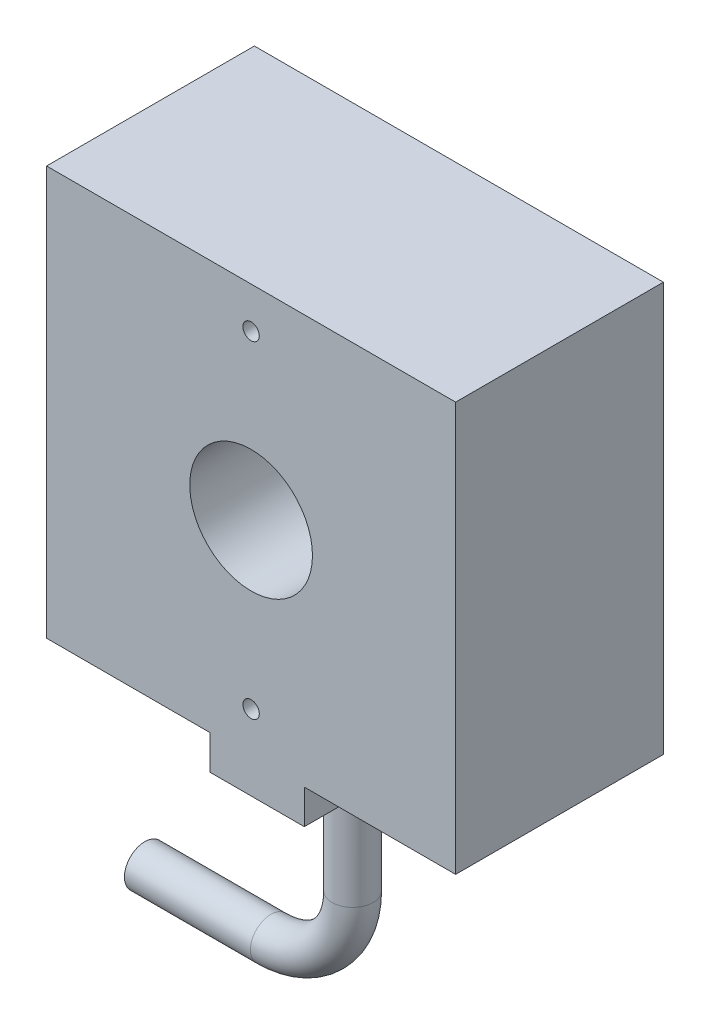
ISO-10303-21;
HEADER;
FILE_DESCRIPTION(('STEP AP214'),'2;1');
FILE_NAME('part.step','',(''),(''),'','','');
FILE_SCHEMA(('AUTOMOTIVE_DESIGN { 1 0 10303 214 1 1 1 1 }'));
ENDSEC;
DATA;
#1=APPLICATION_CONTEXT('core data for automotive mechanical design processes');
#2=APPLICATION_PROTOCOL_DEFINITION('international standard','automotive_design',2000,#1);
#3=PRODUCT_CONTEXT('',#1,'mechanical');
#4=PRODUCT('Part','Part','',(#3));
#5=PRODUCT_RELATED_PRODUCT_CATEGORY('part','',(#4));
#6=PRODUCT_DEFINITION_FORMATION('','',#4);
#7=PRODUCT_DEFINITION_CONTEXT('part definition',#1,'design');
#8=PRODUCT_DEFINITION('design','',#6,#7);
#9=PRODUCT_DEFINITION_SHAPE('','',#8);
#10=(LENGTH_UNIT() NAMED_UNIT(*) SI_UNIT(.MILLI.,.METRE.));
#11=(NAMED_UNIT(*) PLANE_ANGLE_UNIT() SI_UNIT($,.RADIAN.));
#12=(NAMED_UNIT(*) SI_UNIT($,.STERADIAN.) SOLID_ANGLE_UNIT());
#13=UNCERTAINTY_MEASURE_WITH_UNIT(LENGTH_MEASURE(1.E-05),#10,'distance_accuracy_value','');
#14=(GEOMETRIC_REPRESENTATION_CONTEXT(3) GLOBAL_UNCERTAINTY_ASSIGNED_CONTEXT((#13)) GLOBAL_UNIT_ASSIGNED_CONTEXT((#10,
#11,#12)) REPRESENTATION_CONTEXT('',''));
#15=CARTESIAN_POINT('',(0.,0.,0.));
#16=DIRECTION('',(0.,0.,1.));
#17=DIRECTION('',(1.,0.,0.));
#18=AXIS2_PLACEMENT_3D('',#15,#16,#17);
#19=CARTESIAN_POINT('',(0.,0.,25.4));
#20=DIRECTION('',(0.,1.,0.));
#21=DIRECTION('',(0.,0.,1.));
#22=AXIS2_PLACEMENT_3D('',#19,#20,#21);
#23=PLANE('',#22);
#24=DIRECTION('',(0.,0.,1.));
#25=VECTOR('',#24,1.);
#26=CARTESIAN_POINT('',(31.5062580287799,0.,-12.2486169609837));
#27=LINE('',#26,#25);
#28=CARTESIAN_POINT('',(31.5062580287799,0.,0.));
#29=VERTEX_POINT('',#28);
#30=CARTESIAN_POINT('',(31.5062580287799,0.,25.4));
#31=VERTEX_POINT('',#30);
#32=EDGE_CURVE('E128',#29,#31,#27,.T.);
#33=ORIENTED_EDGE('',*,*,#32,.F.);
#34=DIRECTION('',(1.,0.,0.));
#35=VECTOR('',#34,1.);
#36=CARTESIAN_POINT('',(0.,0.,0.));
#37=LINE('',#36,#35);
#38=CARTESIAN_POINT('',(50.,0.,0.));
#39=VERTEX_POINT('',#38);
#40=EDGE_CURVE('E124',#29,#39,#37,.T.);
#41=ORIENTED_EDGE('',*,*,#40,.T.);
#42=DIRECTION('',(0.,0.,-1.));
#43=VECTOR('',#42,1.);
#44=CARTESIAN_POINT('',(50.,0.,25.4));
#45=LINE('',#44,#43);
#46=CARTESIAN_POINT('',(50.,0.,25.4));
#47=VERTEX_POINT('',#46);
#48=EDGE_CURVE('E214',#47,#39,#45,.T.);
#49=ORIENTED_EDGE('',*,*,#48,.F.);
#50=DIRECTION('',(1.,0.,0.));
#51=VECTOR('',#50,1.);
#52=CARTESIAN_POINT('',(0.,0.,25.4));
#53=LINE('',#52,#51);
#54=EDGE_CURVE('E189',#31,#47,#53,.T.);
#55=ORIENTED_EDGE('',*,*,#54,.F.);
#56=EDGE_LOOP('',(#33,#41,#49,#55));
#57=FACE_BOUND('',#56,.T.);
#58=ADVANCED_FACE('F39',(#57),#23,.F.);
#59=CARTESIAN_POINT('',(0.,0.,25.4));
#60=DIRECTION('',(1.,0.,0.));
#61=DIRECTION('',(0.,0.,-1.));
#62=AXIS2_PLACEMENT_3D('',#59,#60,#61);
#63=PLANE('',#62);
#64=DIRECTION('',(0.,-1.,0.));
#65=VECTOR('',#64,1.);
#66=CARTESIAN_POINT('',(0.,0.,0.));
#67=LINE('',#66,#65);
#68=CARTESIAN_POINT('',(0.,50.,0.));
#69=VERTEX_POINT('',#68);
#70=CARTESIAN_POINT('',(0.,0.,0.));
#71=VERTEX_POINT('',#70);
#72=EDGE_CURVE('E182',#69,#71,#67,.T.);
#73=ORIENTED_EDGE('',*,*,#72,.T.);
#74=DIRECTION('',(0.,0.,-1.));
#75=VECTOR('',#74,1.);
#76=CARTESIAN_POINT('',(0.,0.,25.4));
#77=LINE('',#76,#75);
#78=CARTESIAN_POINT('',(0.,0.,25.4));
#79=VERTEX_POINT('',#78);
#80=EDGE_CURVE('E43',#79,#71,#77,.T.);
#81=ORIENTED_EDGE('',*,*,#80,.F.);
#82=DIRECTION('',(0.,-1.,0.));
#83=VECTOR('',#82,1.);
#84=CARTESIAN_POINT('',(0.,0.,25.4));
#85=LINE('',#84,#83);
#86=CARTESIAN_POINT('',(0.,50.,25.4));
#87=VERTEX_POINT('',#86);
#88=EDGE_CURVE('E186',#87,#79,#85,.T.);
#89=ORIENTED_EDGE('',*,*,#88,.F.);
#90=DIRECTION('',(0.,0.,-1.));
#91=VECTOR('',#90,1.);
#92=CARTESIAN_POINT('',(0.,50.,25.4));
#93=LINE('',#92,#91);
#94=EDGE_CURVE('E197',#87,#69,#93,.T.);
#95=ORIENTED_EDGE('',*,*,#94,.T.);
#96=EDGE_LOOP('',(#73,#81,#89,#95));
#97=FACE_BOUND('',#96,.T.);
#98=ADVANCED_FACE('F41',(#97),#63,.F.);
#99=CARTESIAN_POINT('',(19.9993223415163,0.,0.));
#100=VERTEX_POINT('',#99);
#101=EDGE_CURVE('E201',#71,#100,#37,.T.);
#102=ORIENTED_EDGE('',*,*,#101,.T.);
#103=DIRECTION('',(0.,0.,1.));
#104=VECTOR('',#103,1.);
#105=CARTESIAN_POINT('',(19.9993223415163,0.,-12.2486169609837));
#106=LINE('',#105,#104);
#107=CARTESIAN_POINT('',(19.9993223415163,0.,25.4));
#108=VERTEX_POINT('',#107);
#109=EDGE_CURVE('E153',#100,#108,#106,.T.);
#110=ORIENTED_EDGE('',*,*,#109,.T.);
#111=EDGE_CURVE('E93',#79,#108,#53,.T.);
#112=ORIENTED_EDGE('',*,*,#111,.F.);
#113=ORIENTED_EDGE('',*,*,#80,.T.);
#114=EDGE_LOOP('',(#102,#110,#112,#113));
#115=FACE_BOUND('',#114,.T.);
#116=ADVANCED_FACE('F222',(#115),#23,.F.);
#117=CARTESIAN_POINT('',(50.,0.,25.4));
#118=DIRECTION('',(-1.,0.,0.));
#119=DIRECTION('',(0.,0.,1.));
#120=AXIS2_PLACEMENT_3D('',#117,#118,#119);
#121=PLANE('',#120);
#122=DIRECTION('',(0.,1.,0.));
#123=VECTOR('',#122,1.);
#124=CARTESIAN_POINT('',(50.,0.,0.));
#125=LINE('',#124,#123);
#126=CARTESIAN_POINT('',(50.,50.,0.));
#127=VERTEX_POINT('',#126);
#128=EDGE_CURVE('E205',#39,#127,#125,.T.);
#129=ORIENTED_EDGE('',*,*,#128,.T.);
#130=DIRECTION('',(0.,0.,-1.));
#131=VECTOR('',#130,1.);
#132=CARTESIAN_POINT('',(50.,50.,25.4));
#133=LINE('',#132,#131);
#134=CARTESIAN_POINT('',(50.,50.,25.4));
#135=VERTEX_POINT('',#134);
#136=EDGE_CURVE('E212',#135,#127,#133,.T.);
#137=ORIENTED_EDGE('',*,*,#136,.F.);
#138=DIRECTION('',(0.,1.,0.));
#139=VECTOR('',#138,1.);
#140=CARTESIAN_POINT('',(50.,0.,25.4));
#141=LINE('',#140,#139);
#142=EDGE_CURVE('E192',#47,#135,#141,.T.);
#143=ORIENTED_EDGE('',*,*,#142,.F.);
#144=ORIENTED_EDGE('',*,*,#48,.T.);
#145=EDGE_LOOP('',(#129,#137,#143,#144));
#146=FACE_BOUND('',#145,.T.);
#147=ADVANCED_FACE('F273',(#146),#121,.F.);
#148=CARTESIAN_POINT('',(0.,50.,25.4));
#149=DIRECTION('',(0.,-1.,0.));
#150=DIRECTION('',(0.,0.,-1.));
#151=AXIS2_PLACEMENT_3D('',#148,#149,#150);
#152=PLANE('',#151);
#153=DIRECTION('',(-1.,0.,0.));
#154=VECTOR('',#153,1.);
#155=CARTESIAN_POINT('',(0.,50.,0.));
#156=LINE('',#155,#154);
#157=EDGE_CURVE('E86',#127,#69,#156,.T.);
#158=ORIENTED_EDGE('',*,*,#157,.T.);
#159=ORIENTED_EDGE('',*,*,#94,.F.);
#160=DIRECTION('',(-1.,0.,0.));
#161=VECTOR('',#160,1.);
#162=CARTESIAN_POINT('',(0.,50.,25.4));
#163=LINE('',#162,#161);
#164=EDGE_CURVE('E65',#135,#87,#163,.T.);
#165=ORIENTED_EDGE('',*,*,#164,.F.);
#166=ORIENTED_EDGE('',*,*,#136,.T.);
#167=EDGE_LOOP('',(#158,#159,#165,#166));
#168=FACE_BOUND('',#167,.T.);
#169=ADVANCED_FACE('F277',(#168),#152,.F.);
#170=CARTESIAN_POINT('',(0.,0.,25.4));
#171=DIRECTION('',(0.,0.,-1.));
#172=DIRECTION('',(-1.,0.,0.));
#173=AXIS2_PLACEMENT_3D('',#170,#171,#172);
#174=PLANE('',#173);
#175=CARTESIAN_POINT('',(25.,5.,25.4));
#176=DIRECTION('',(0.,0.,1.));
#177=DIRECTION('',(1.,0.,0.));
#178=AXIS2_PLACEMENT_3D('',#175,#176,#177);
#179=CIRCLE('',#178,1.);
#180=CARTESIAN_POINT('',(26.,5.,25.4));
#181=VERTEX_POINT('',#180);
#182=EDGE_CURVE('E161',#181,#181,#179,.T.);
#183=ORIENTED_EDGE('',*,*,#182,.F.);
#184=EDGE_LOOP('',(#183));
#185=FACE_BOUND('',#184,.T.);
#186=CARTESIAN_POINT('',(25.,45.,25.4));
#187=DIRECTION('',(0.,0.,1.));
#188=DIRECTION('',(1.,0.,0.));
#189=AXIS2_PLACEMENT_3D('',#186,#187,#188);
#190=CIRCLE('',#189,1.);
#191=CARTESIAN_POINT('',(26.,45.,25.4));
#192=VERTEX_POINT('',#191);
#193=EDGE_CURVE('E167',#192,#192,#190,.T.);
#194=ORIENTED_EDGE('',*,*,#193,.F.);
#195=EDGE_LOOP('',(#194));
#196=FACE_BOUND('',#195,.T.);
#197=CARTESIAN_POINT('',(25.,25.,25.4));
#198=DIRECTION('',(0.,0.,1.));
#199=DIRECTION('',(1.,0.,0.));
#200=AXIS2_PLACEMENT_3D('',#197,#198,#199);
#201=CIRCLE('',#200,7.5);
#202=CARTESIAN_POINT('',(32.5,25.,25.4));
#203=VERTEX_POINT('',#202);
#204=EDGE_CURVE('E166',#203,#203,#201,.T.);
#205=ORIENTED_EDGE('',*,*,#204,.F.);
#206=EDGE_LOOP('',(#205));
#207=FACE_BOUND('',#206,.T.);
#208=ORIENTED_EDGE('',*,*,#88,.T.);
#209=ORIENTED_EDGE('',*,*,#111,.T.);
#210=DIRECTION('',(0.,-1.,0.));
#211=VECTOR('',#210,1.);
#212=CARTESIAN_POINT('',(19.9993223415163,0.,25.4));
#213=LINE('',#212,#211);
#214=CARTESIAN_POINT('',(19.9993223415163,-4.19750503824342,25.4));
#215=VERTEX_POINT('',#214);
#216=EDGE_CURVE('E56',#108,#215,#213,.T.);
#217=ORIENTED_EDGE('',*,*,#216,.T.);
#218=DIRECTION('',(1.,0.,0.));
#219=VECTOR('',#218,1.);
#220=CARTESIAN_POINT('',(19.9993223415163,-4.19750503824342,25.4));
#221=LINE('',#220,#219);
#222=CARTESIAN_POINT('',(31.5062580287799,-4.19750503824342,25.4));
#223=VERTEX_POINT('',#222);
#224=EDGE_CURVE('E146',#215,#223,#221,.T.);
#225=ORIENTED_EDGE('',*,*,#224,.T.);
#226=DIRECTION('',(0.,1.,0.));
#227=VECTOR('',#226,1.);
#228=CARTESIAN_POINT('',(31.5062580287799,0.,25.4));
#229=LINE('',#228,#227);
#230=EDGE_CURVE('E134',#223,#31,#229,.T.);
#231=ORIENTED_EDGE('',*,*,#230,.T.);
#232=ORIENTED_EDGE('',*,*,#54,.T.);
#233=ORIENTED_EDGE('',*,*,#142,.T.);
#234=ORIENTED_EDGE('',*,*,#164,.T.);
#235=EDGE_LOOP('',(#208,#209,#217,#225,#231,#232,#233,#234));
#236=FACE_BOUND('',#235,.T.);
#237=ADVANCED_FACE('F226',(#185,#196,#207,#236),#174,.F.);
#238=CARTESIAN_POINT('',(0.,0.,0.));
#239=DIRECTION('',(0.,0.,-1.));
#240=DIRECTION('',(-1.,0.,0.));
#241=AXIS2_PLACEMENT_3D('',#238,#239,#240);
#242=PLANE('',#241);
#243=CARTESIAN_POINT('',(25.,5.,0.));
#244=DIRECTION('',(0.,0.,1.));
#245=DIRECTION('',(1.,0.,0.));
#246=AXIS2_PLACEMENT_3D('',#243,#244,#245);
#247=CIRCLE('',#246,1.);
#248=CARTESIAN_POINT('',(26.,5.,0.));
#249=VERTEX_POINT('',#248);
#250=EDGE_CURVE('E171',#249,#249,#247,.T.);
#251=ORIENTED_EDGE('',*,*,#250,.T.);
#252=EDGE_LOOP('',(#251));
#253=FACE_BOUND('',#252,.T.);
#254=CARTESIAN_POINT('',(25.,45.,0.));
#255=DIRECTION('',(0.,0.,1.));
#256=DIRECTION('',(1.,0.,0.));
#257=AXIS2_PLACEMENT_3D('',#254,#255,#256);
#258=CIRCLE('',#257,1.);
#259=CARTESIAN_POINT('',(26.,45.,0.));
#260=VERTEX_POINT('',#259);
#261=EDGE_CURVE('E162',#260,#260,#258,.T.);
#262=ORIENTED_EDGE('',*,*,#261,.T.);
#263=EDGE_LOOP('',(#262));
#264=FACE_BOUND('',#263,.T.);
#265=CARTESIAN_POINT('',(25.,25.,0.));
#266=DIRECTION('',(0.,0.,1.));
#267=DIRECTION('',(1.,0.,0.));
#268=AXIS2_PLACEMENT_3D('',#265,#266,#267);
#269=CIRCLE('',#268,7.5);
#270=CARTESIAN_POINT('',(32.5,25.,0.));
#271=VERTEX_POINT('',#270);
#272=EDGE_CURVE('E178',#271,#271,#269,.T.);
#273=ORIENTED_EDGE('',*,*,#272,.T.);
#274=EDGE_LOOP('',(#273));
#275=FACE_BOUND('',#274,.T.);
#276=ORIENTED_EDGE('',*,*,#72,.F.);
#277=ORIENTED_EDGE('',*,*,#157,.F.);
#278=ORIENTED_EDGE('',*,*,#128,.F.);
#279=ORIENTED_EDGE('',*,*,#40,.F.);
#280=DIRECTION('',(0.,1.,0.));
#281=VECTOR('',#280,1.);
#282=CARTESIAN_POINT('',(31.5062580287799,0.,0.));
#283=LINE('',#282,#281);
#284=CARTESIAN_POINT('',(31.5062580287799,-4.19750503824342,0.));
#285=VERTEX_POINT('',#284);
#286=EDGE_CURVE('E116',#285,#29,#283,.T.);
#287=ORIENTED_EDGE('',*,*,#286,.F.);
#288=DIRECTION('',(1.,0.,0.));
#289=VECTOR('',#288,1.);
#290=CARTESIAN_POINT('',(19.9993223415163,-4.19750503824342,0.));
#291=LINE('',#290,#289);
#292=CARTESIAN_POINT('',(19.9993223415163,-4.19750503824342,0.));
#293=VERTEX_POINT('',#292);
#294=EDGE_CURVE('E121',#293,#285,#291,.T.);
#295=ORIENTED_EDGE('',*,*,#294,.F.);
#296=DIRECTION('',(0.,-1.,0.));
#297=VECTOR('',#296,1.);
#298=CARTESIAN_POINT('',(19.9993223415163,0.,0.));
#299=LINE('',#298,#297);
#300=EDGE_CURVE('E151',#100,#293,#299,.T.);
#301=ORIENTED_EDGE('',*,*,#300,.F.);
#302=ORIENTED_EDGE('',*,*,#101,.F.);
#303=EDGE_LOOP('',(#276,#277,#278,#279,#287,#295,#301,#302));
#304=FACE_BOUND('',#303,.T.);
#305=ADVANCED_FACE('F119',(#253,#264,#275,#304),#242,.T.);
#306=CARTESIAN_POINT('',(25.,25.,0.));
#307=DIRECTION('',(0.,0.,1.));
#308=DIRECTION('',(1.,0.,0.));
#309=AXIS2_PLACEMENT_3D('',#306,#307,#308);
#310=CYLINDRICAL_SURFACE('',#309,7.5);
#311=ORIENTED_EDGE('',*,*,#272,.F.);
#312=EDGE_LOOP('',(#311));
#313=FACE_BOUND('',#312,.T.);
#314=ORIENTED_EDGE('',*,*,#204,.T.);
#315=EDGE_LOOP('',(#314));
#316=FACE_BOUND('',#315,.T.);
#317=ADVANCED_FACE('F285',(#313,#316),#310,.F.);
#318=CARTESIAN_POINT('',(25.,45.,0.));
#319=DIRECTION('',(0.,0.,1.));
#320=DIRECTION('',(1.,0.,0.));
#321=AXIS2_PLACEMENT_3D('',#318,#319,#320);
#322=CYLINDRICAL_SURFACE('',#321,1.);
#323=ORIENTED_EDGE('',*,*,#261,.F.);
#324=EDGE_LOOP('',(#323));
#325=FACE_BOUND('',#324,.T.);
#326=ORIENTED_EDGE('',*,*,#193,.T.);
#327=EDGE_LOOP('',(#326));
#328=FACE_BOUND('',#327,.T.);
#329=ADVANCED_FACE('F262',(#325,#328),#322,.F.);
#330=CARTESIAN_POINT('',(25.,5.,0.));
#331=DIRECTION('',(0.,0.,1.));
#332=DIRECTION('',(1.,0.,0.));
#333=AXIS2_PLACEMENT_3D('',#330,#331,#332);
#334=CYLINDRICAL_SURFACE('',#333,1.);
#335=ORIENTED_EDGE('',*,*,#250,.F.);
#336=EDGE_LOOP('',(#335));
#337=FACE_BOUND('',#336,.T.);
#338=ORIENTED_EDGE('',*,*,#182,.T.);
#339=EDGE_LOOP('',(#338));
#340=FACE_BOUND('',#339,.T.);
#341=ADVANCED_FACE('F255',(#337,#340),#334,.F.);
#342=CARTESIAN_POINT('',(19.9993223415163,-4.19750503824342,-12.2486169609837));
#343=DIRECTION('',(0.,-1.,0.));
#344=DIRECTION('',(0.,0.,-1.));
#345=AXIS2_PLACEMENT_3D('',#342,#343,#344);
#346=PLANE('',#345);
#347=CARTESIAN_POINT('',(25.836773000717,-4.19750503824342,13.8253154147573));
#348=DIRECTION('',(0.,-1.,0.));
#349=DIRECTION('',(0.,0.,-1.));
#350=AXIS2_PLACEMENT_3D('',#347,#348,#349);
#351=CIRCLE('',#350,2.5);
#352=CARTESIAN_POINT('',(25.836773000717,-4.19750503824342,11.3253154147573));
#353=VERTEX_POINT('',#352);
#354=EDGE_CURVE('E11',#353,#353,#351,.T.);
#355=ORIENTED_EDGE('',*,*,#354,.F.);
#356=EDGE_LOOP('',(#355));
#357=FACE_BOUND('',#356,.T.);
#358=DIRECTION('',(0.,0.,1.));
#359=VECTOR('',#358,1.);
#360=CARTESIAN_POINT('',(19.9993223415163,-4.19750503824342,-12.2486169609837));
#361=LINE('',#360,#359);
#362=EDGE_CURVE('E142',#293,#215,#361,.T.);
#363=ORIENTED_EDGE('',*,*,#362,.F.);
#364=ORIENTED_EDGE('',*,*,#294,.T.);
#365=DIRECTION('',(0.,0.,1.));
#366=VECTOR('',#365,1.);
#367=CARTESIAN_POINT('',(31.5062580287799,-4.19750503824342,-12.2486169609837));
#368=LINE('',#367,#366);
#369=EDGE_CURVE('E129',#285,#223,#368,.T.);
#370=ORIENTED_EDGE('',*,*,#369,.T.);
#371=ORIENTED_EDGE('',*,*,#224,.F.);
#372=EDGE_LOOP('',(#363,#364,#370,#371));
#373=FACE_BOUND('',#372,.T.);
#374=ADVANCED_FACE('F141',(#357,#373),#346,.T.);
#375=CARTESIAN_POINT('',(31.5062580287799,0.,-12.2486169609837));
#376=DIRECTION('',(1.,0.,0.));
#377=DIRECTION('',(0.,0.,-1.));
#378=AXIS2_PLACEMENT_3D('',#375,#376,#377);
#379=PLANE('',#378);
#380=ORIENTED_EDGE('',*,*,#369,.F.);
#381=ORIENTED_EDGE('',*,*,#286,.T.);
#382=ORIENTED_EDGE('',*,*,#32,.T.);
#383=ORIENTED_EDGE('',*,*,#230,.F.);
#384=EDGE_LOOP('',(#380,#381,#382,#383));
#385=FACE_BOUND('',#384,.T.);
#386=ADVANCED_FACE('F132',(#385),#379,.T.);
#387=CARTESIAN_POINT('',(19.9993223415163,0.,-12.2486169609837));
#388=DIRECTION('',(-1.,0.,0.));
#389=DIRECTION('',(0.,0.,1.));
#390=AXIS2_PLACEMENT_3D('',#387,#388,#389);
#391=PLANE('',#390);
#392=ORIENTED_EDGE('',*,*,#109,.F.);
#393=ORIENTED_EDGE('',*,*,#300,.T.);
#394=ORIENTED_EDGE('',*,*,#362,.T.);
#395=ORIENTED_EDGE('',*,*,#216,.F.);
#396=EDGE_LOOP('',(#392,#393,#394,#395));
#397=FACE_BOUND('',#396,.T.);
#398=ADVANCED_FACE('F225',(#397),#391,.T.);
#399=CARTESIAN_POINT('',(0.436773000717001,-29.5975050382434,13.8253154147573));
#400=DIRECTION('',(-1.,0.,0.));
#401=DIRECTION('',(0.,0.,-1.));
#402=AXIS2_PLACEMENT_3D('',#399,#400,#401);
#403=PLANE('',#402);
#404=CARTESIAN_POINT('',(0.436773000717001,-29.5975050382434,13.8253154147573));
#405=DIRECTION('',(-1.,0.,0.));
#406=DIRECTION('',(0.,0.,-1.));
#407=AXIS2_PLACEMENT_3D('',#404,#405,#406);
#408=CIRCLE('',#407,2.5);
#409=CARTESIAN_POINT('',(0.436773000717001,-29.5975050382434,11.3253154147573));
#410=VERTEX_POINT('',#409);
#411=EDGE_CURVE('E228',#410,#410,#408,.T.);
#412=ORIENTED_EDGE('',*,*,#411,.T.);
#413=EDGE_LOOP('',(#412));
#414=FACE_BOUND('',#413,.T.);
#415=ADVANCED_FACE('F250',(#414),#403,.T.);
#416=CARTESIAN_POINT('',(25.836773000717,-4.19750503824342,13.8253154147573));
#417=DIRECTION('',(0.,-1.,0.));
#418=DIRECTION('',(0.,0.,-1.));
#419=AXIS2_PLACEMENT_3D('',#416,#417,#418);
#420=CYLINDRICAL_SURFACE('',#419,2.5);
#421=CARTESIAN_POINT('',(25.836773000717,-19.5975050382433,13.8253154147573));
#422=DIRECTION('',(0.,-1.,0.));
#423=DIRECTION('',(0.,0.,-1.));
#424=AXIS2_PLACEMENT_3D('',#421,#422,#423);
#425=CIRCLE('',#424,2.5);
#426=CARTESIAN_POINT('',(28.336773000717,-19.5975050382433,13.8253154147573));
#427=VERTEX_POINT('',#426);
#428=EDGE_CURVE('E238',#427,#427,#425,.T.);
#429=ORIENTED_EDGE('',*,*,#428,.F.);
#430=EDGE_LOOP('',(#429));
#431=FACE_BOUND('',#430,.T.);
#432=ORIENTED_EDGE('',*,*,#354,.T.);
#433=EDGE_LOOP('',(#432));
#434=FACE_BOUND('',#433,.T.);
#435=ADVANCED_FACE('F247',(#431,#434),#420,.T.);
#436=CARTESIAN_POINT('',(15.836773000717,-19.5975050382434,13.8253154147573));
#437=DIRECTION('',(0.,0.,-1.));
#438=DIRECTION('',(-1.,0.,0.));
#439=AXIS2_PLACEMENT_3D('',#436,#437,#438);
#440=TOROIDAL_SURFACE('',#439,9.99999999999997,2.5);
#441=CARTESIAN_POINT('',(15.8367730007169,-29.5975050382434,13.8253154147573));
#442=DIRECTION('',(-1.,0.,0.));
#443=DIRECTION('',(0.,0.,-1.));
#444=AXIS2_PLACEMENT_3D('',#441,#442,#443);
#445=CIRCLE('',#444,2.5);
#446=CARTESIAN_POINT('',(15.8367730007169,-32.0975050382434,13.8253154147573));
#447=VERTEX_POINT('',#446);
#448=EDGE_CURVE('E232',#447,#447,#445,.T.);
#449=CARTESIAN_POINT('',(15.836773000717,-19.5975050382434,13.8253154147573));
#450=DIRECTION('',(0.,0.,-1.));
#451=DIRECTION('',(-1.,0.,0.));
#452=AXIS2_PLACEMENT_3D('',#449,#450,#451);
#453=CIRCLE('',#452,12.5);
#454=EDGE_CURVE('',#427,#447,#453,.T.);
#455=ORIENTED_EDGE('',*,*,#428,.T.);
#456=ORIENTED_EDGE('',*,*,#448,.F.);
#457=ORIENTED_EDGE('',*,*,#454,.T.);
#458=ORIENTED_EDGE('',*,*,#454,.F.);
#459=EDGE_LOOP('',(#455,#457,#456,#458));
#460=FACE_BOUND('',#459,.T.);
#461=ADVANCED_FACE('F245',(#460),#440,.T.);
#462=CARTESIAN_POINT('',(15.8367730007169,-29.5975050382434,13.8253154147573));
#463=DIRECTION('',(-1.,0.,0.));
#464=DIRECTION('',(0.,0.,1.));
#465=AXIS2_PLACEMENT_3D('',#462,#463,#464);
#466=CYLINDRICAL_SURFACE('',#465,2.5);
#467=ORIENTED_EDGE('',*,*,#411,.F.);
#468=EDGE_LOOP('',(#467));
#469=FACE_BOUND('',#468,.T.);
#470=ORIENTED_EDGE('',*,*,#448,.T.);
#471=EDGE_LOOP('',(#470));
#472=FACE_BOUND('',#471,.T.);
#473=ADVANCED_FACE('F352',(#469,#472),#466,.T.);
#474=CLOSED_SHELL('',(#58,#98,#116,#147,#169,#237,#305,#317,#329,#341,#374,#386,#398,#415,#435,
#461,#473));
#475=MANIFOLD_SOLID_BREP('B2',#474);
#476=ADVANCED_BREP_SHAPE_REPRESENTATION('',(#18,#475),#14);
#477=SHAPE_DEFINITION_REPRESENTATION(#9,#476);
ENDSEC;
END-ISO-10303-21;
